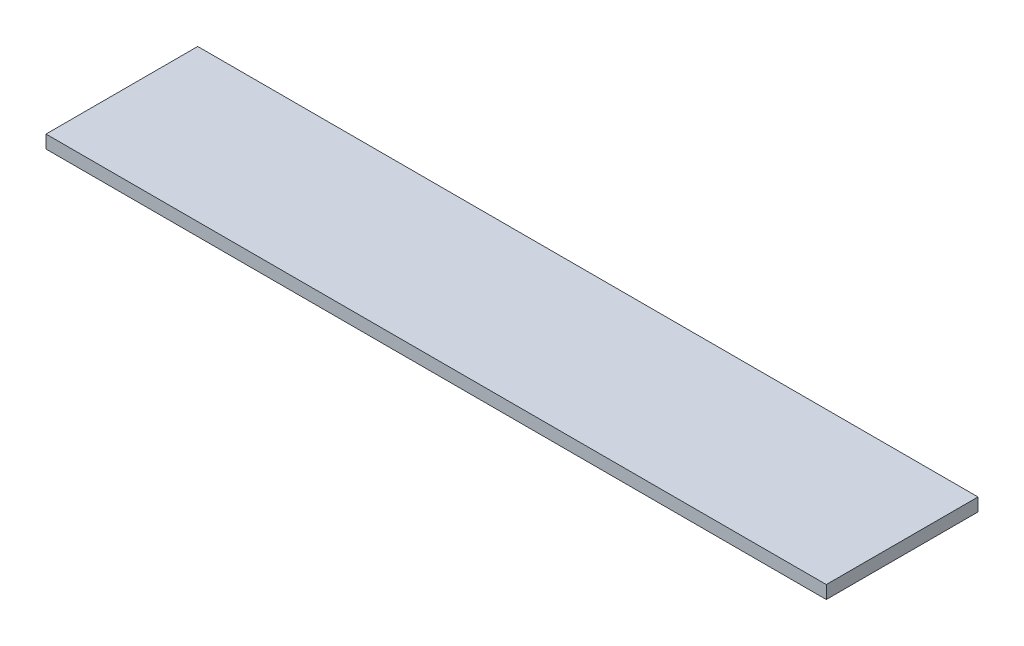
ISO-10303-21;
HEADER;
FILE_DESCRIPTION(('STEP AP214'),'2;1');
FILE_NAME('part.step','',(''),(''),'','','');
FILE_SCHEMA(('AUTOMOTIVE_DESIGN { 1 0 10303 214 1 1 1 1 }'));
ENDSEC;
DATA;
#1=APPLICATION_CONTEXT('core data for automotive mechanical design processes');
#2=APPLICATION_PROTOCOL_DEFINITION('international standard','automotive_design',2000,#1);
#3=PRODUCT_CONTEXT('',#1,'mechanical');
#4=PRODUCT('Part','Part','',(#3));
#5=PRODUCT_RELATED_PRODUCT_CATEGORY('part','',(#4));
#6=PRODUCT_DEFINITION_FORMATION('','',#4);
#7=PRODUCT_DEFINITION_CONTEXT('part definition',#1,'design');
#8=PRODUCT_DEFINITION('design','',#6,#7);
#9=PRODUCT_DEFINITION_SHAPE('','',#8);
#10=(LENGTH_UNIT() NAMED_UNIT(*) SI_UNIT(.MILLI.,.METRE.));
#11=(NAMED_UNIT(*) PLANE_ANGLE_UNIT() SI_UNIT($,.RADIAN.));
#12=(NAMED_UNIT(*) SI_UNIT($,.STERADIAN.) SOLID_ANGLE_UNIT());
#13=UNCERTAINTY_MEASURE_WITH_UNIT(LENGTH_MEASURE(1.E-05),#10,'distance_accuracy_value','');
#14=(GEOMETRIC_REPRESENTATION_CONTEXT(3) GLOBAL_UNCERTAINTY_ASSIGNED_CONTEXT((#13)) GLOBAL_UNIT_ASSIGNED_CONTEXT((#10,
#11,#12)) REPRESENTATION_CONTEXT('',''));
#15=CARTESIAN_POINT('',(0.,0.,0.));
#16=DIRECTION('',(0.,0.,1.));
#17=DIRECTION('',(1.,0.,0.));
#18=AXIS2_PLACEMENT_3D('',#15,#16,#17);
#19=CARTESIAN_POINT('',(-104.686936777344,3.,-23.6057346795657));
#20=DIRECTION('',(1.,0.,0.));
#21=DIRECTION('',(0.,0.,-1.));
#22=AXIS2_PLACEMENT_3D('',#19,#20,#21);
#23=PLANE('',#22);
#24=DIRECTION('',(0.,0.,1.));
#25=VECTOR('',#24,1.);
#26=CARTESIAN_POINT('',(-104.686936777344,0.,-23.6057346795657));
#27=LINE('',#26,#25);
#28=CARTESIAN_POINT('',(-104.686936777344,0.,-58.6057346795657));
#29=VERTEX_POINT('',#28);
#30=CARTESIAN_POINT('',(-104.686936777344,0.,-23.6057346795657));
#31=VERTEX_POINT('',#30);
#32=EDGE_CURVE('E96',#29,#31,#27,.T.);
#33=ORIENTED_EDGE('',*,*,#32,.T.);
#34=DIRECTION('',(0.,-1.,0.));
#35=VECTOR('',#34,1.);
#36=CARTESIAN_POINT('',(-104.686936777344,3.,-23.6057346795657));
#37=LINE('',#36,#35);
#38=CARTESIAN_POINT('',(-104.686936777344,3.,-23.6057346795657));
#39=VERTEX_POINT('',#38);
#40=EDGE_CURVE('E11',#39,#31,#37,.T.);
#41=ORIENTED_EDGE('',*,*,#40,.F.);
#42=DIRECTION('',(0.,0.,1.));
#43=VECTOR('',#42,1.);
#44=CARTESIAN_POINT('',(-104.686936777344,3.,-23.6057346795657));
#45=LINE('',#44,#43);
#46=CARTESIAN_POINT('',(-104.686936777344,3.,-58.6057346795657));
#47=VERTEX_POINT('',#46);
#48=EDGE_CURVE('E84',#47,#39,#45,.T.);
#49=ORIENTED_EDGE('',*,*,#48,.F.);
#50=DIRECTION('',(0.,-1.,0.));
#51=VECTOR('',#50,1.);
#52=CARTESIAN_POINT('',(-104.686936777344,3.,-58.6057346795657));
#53=LINE('',#52,#51);
#54=EDGE_CURVE('E92',#47,#29,#53,.T.);
#55=ORIENTED_EDGE('',*,*,#54,.T.);
#56=EDGE_LOOP('',(#33,#41,#49,#55));
#57=FACE_BOUND('',#56,.T.);
#58=ADVANCED_FACE('F33',(#57),#23,.F.);
#59=CARTESIAN_POINT('',(-104.686936777344,3.,-23.6057346795657));
#60=DIRECTION('',(0.,0.,-1.));
#61=DIRECTION('',(-1.,0.,0.));
#62=AXIS2_PLACEMENT_3D('',#59,#60,#61);
#63=PLANE('',#62);
#64=DIRECTION('',(1.,0.,0.));
#65=VECTOR('',#64,1.);
#66=CARTESIAN_POINT('',(-104.686936777344,0.,-23.6057346795657));
#67=LINE('',#66,#65);
#68=CARTESIAN_POINT('',(75.3130632226565,0.,-23.6057346795657));
#69=VERTEX_POINT('',#68);
#70=EDGE_CURVE('E88',#31,#69,#67,.T.);
#71=ORIENTED_EDGE('',*,*,#70,.T.);
#72=DIRECTION('',(0.,-1.,0.));
#73=VECTOR('',#72,1.);
#74=CARTESIAN_POINT('',(75.3130632226565,3.,-23.6057346795657));
#75=LINE('',#74,#73);
#76=CARTESIAN_POINT('',(75.3130632226565,3.,-23.6057346795657));
#77=VERTEX_POINT('',#76);
#78=EDGE_CURVE('E41',#77,#69,#75,.T.);
#79=ORIENTED_EDGE('',*,*,#78,.F.);
#80=DIRECTION('',(1.,0.,0.));
#81=VECTOR('',#80,1.);
#82=CARTESIAN_POINT('',(-104.686936777344,3.,-23.6057346795657));
#83=LINE('',#82,#81);
#84=EDGE_CURVE('E79',#39,#77,#83,.T.);
#85=ORIENTED_EDGE('',*,*,#84,.F.);
#86=ORIENTED_EDGE('',*,*,#40,.T.);
#87=EDGE_LOOP('',(#71,#79,#85,#86));
#88=FACE_BOUND('',#87,.T.);
#89=ADVANCED_FACE('F87',(#88),#63,.F.);
#90=CARTESIAN_POINT('',(75.3130632226565,3.,-23.6057346795657));
#91=DIRECTION('',(-1.,0.,0.));
#92=DIRECTION('',(0.,0.,1.));
#93=AXIS2_PLACEMENT_3D('',#90,#91,#92);
#94=PLANE('',#93);
#95=DIRECTION('',(0.,0.,-1.));
#96=VECTOR('',#95,1.);
#97=CARTESIAN_POINT('',(75.3130632226565,0.,-23.6057346795657));
#98=LINE('',#97,#96);
#99=CARTESIAN_POINT('',(75.3130632226565,0.,-58.6057346795657));
#100=VERTEX_POINT('',#99);
#101=EDGE_CURVE('E66',#69,#100,#98,.T.);
#102=ORIENTED_EDGE('',*,*,#101,.T.);
#103=DIRECTION('',(0.,-1.,0.));
#104=VECTOR('',#103,1.);
#105=CARTESIAN_POINT('',(75.3130632226565,3.,-58.6057346795657));
#106=LINE('',#105,#104);
#107=CARTESIAN_POINT('',(75.3130632226565,3.,-58.6057346795657));
#108=VERTEX_POINT('',#107);
#109=EDGE_CURVE('E89',#108,#100,#106,.T.);
#110=ORIENTED_EDGE('',*,*,#109,.F.);
#111=DIRECTION('',(0.,0.,-1.));
#112=VECTOR('',#111,1.);
#113=CARTESIAN_POINT('',(75.3130632226565,3.,-23.6057346795657));
#114=LINE('',#113,#112);
#115=EDGE_CURVE('E82',#77,#108,#114,.T.);
#116=ORIENTED_EDGE('',*,*,#115,.F.);
#117=ORIENTED_EDGE('',*,*,#78,.T.);
#118=EDGE_LOOP('',(#102,#110,#116,#117));
#119=FACE_BOUND('',#118,.T.);
#120=ADVANCED_FACE('F90',(#119),#94,.F.);
#121=CARTESIAN_POINT('',(-104.686936777344,3.,-58.6057346795657));
#122=DIRECTION('',(0.,0.,1.));
#123=DIRECTION('',(1.,0.,0.));
#124=AXIS2_PLACEMENT_3D('',#121,#122,#123);
#125=PLANE('',#124);
#126=DIRECTION('',(-1.,0.,0.));
#127=VECTOR('',#126,1.);
#128=CARTESIAN_POINT('',(-104.686936777344,0.,-58.6057346795657));
#129=LINE('',#128,#127);
#130=EDGE_CURVE('E72',#100,#29,#129,.T.);
#131=ORIENTED_EDGE('',*,*,#130,.T.);
#132=ORIENTED_EDGE('',*,*,#54,.F.);
#133=DIRECTION('',(-1.,0.,0.));
#134=VECTOR('',#133,1.);
#135=CARTESIAN_POINT('',(-104.686936777344,3.,-58.6057346795657));
#136=LINE('',#135,#134);
#137=EDGE_CURVE('E49',#108,#47,#136,.T.);
#138=ORIENTED_EDGE('',*,*,#137,.F.);
#139=ORIENTED_EDGE('',*,*,#109,.T.);
#140=EDGE_LOOP('',(#131,#132,#138,#139));
#141=FACE_BOUND('',#140,.T.);
#142=ADVANCED_FACE('F103',(#141),#125,.F.);
#143=CARTESIAN_POINT('',(0.,3.,0.));
#144=DIRECTION('',(0.,-1.,0.));
#145=DIRECTION('',(0.,0.,-1.));
#146=AXIS2_PLACEMENT_3D('',#143,#144,#145);
#147=PLANE('',#146);
#148=ORIENTED_EDGE('',*,*,#48,.T.);
#149=ORIENTED_EDGE('',*,*,#84,.T.);
#150=ORIENTED_EDGE('',*,*,#115,.T.);
#151=ORIENTED_EDGE('',*,*,#137,.T.);
#152=EDGE_LOOP('',(#148,#149,#150,#151));
#153=FACE_BOUND('',#152,.T.);
#154=ADVANCED_FACE('F80',(#153),#147,.F.);
#155=CARTESIAN_POINT('',(0.,0.,0.));
#156=DIRECTION('',(0.,-1.,0.));
#157=DIRECTION('',(0.,0.,-1.));
#158=AXIS2_PLACEMENT_3D('',#155,#156,#157);
#159=PLANE('',#158);
#160=ORIENTED_EDGE('',*,*,#32,.F.);
#161=ORIENTED_EDGE('',*,*,#130,.F.);
#162=ORIENTED_EDGE('',*,*,#101,.F.);
#163=ORIENTED_EDGE('',*,*,#70,.F.);
#164=EDGE_LOOP('',(#160,#161,#162,#163));
#165=FACE_BOUND('',#164,.T.);
#166=ADVANCED_FACE('F106',(#165),#159,.T.);
#167=CLOSED_SHELL('',(#58,#89,#120,#142,#154,#166));
#168=MANIFOLD_SOLID_BREP('B2',#167);
#169=ADVANCED_BREP_SHAPE_REPRESENTATION('',(#18,#168),#14);
#170=SHAPE_DEFINITION_REPRESENTATION(#9,#169);
ENDSEC;
END-ISO-10303-21;
